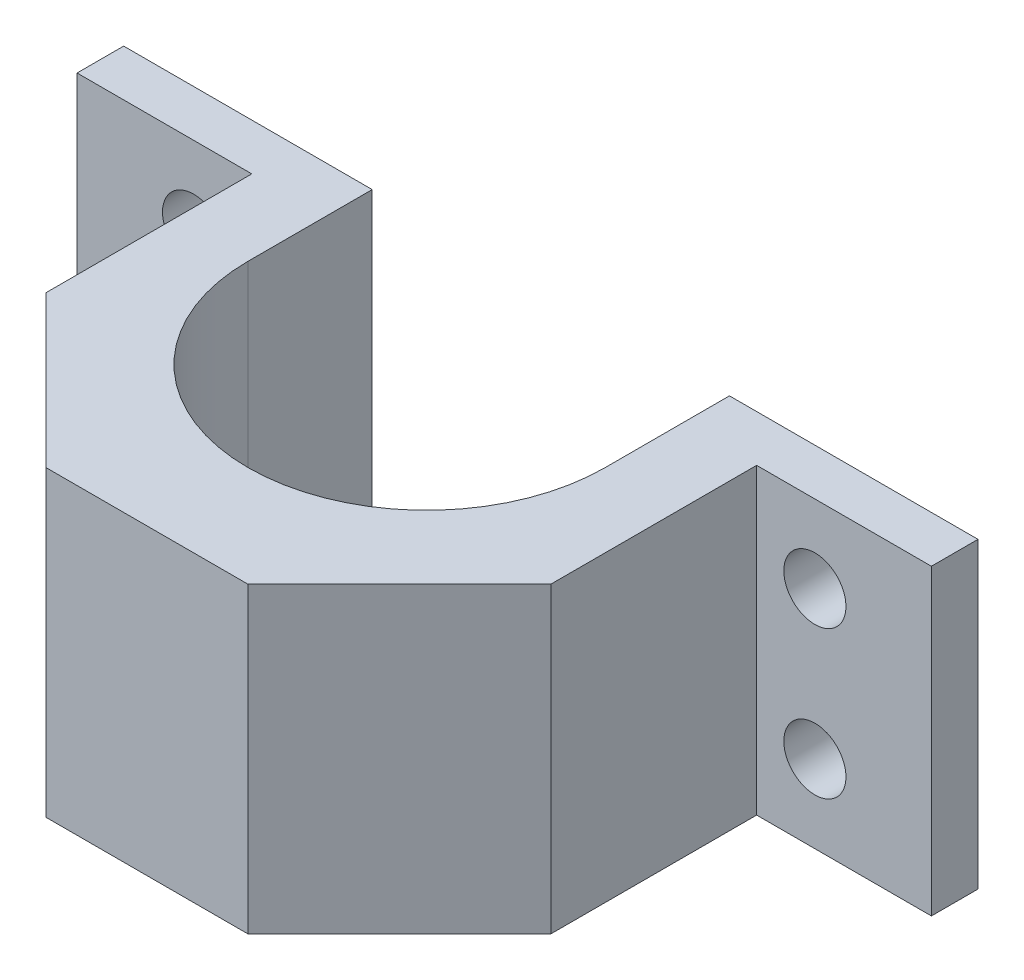
ISO-10303-21;
HEADER;
FILE_DESCRIPTION(('STEP AP214'),'2;1');
FILE_NAME('part.step','',(''),(''),'','','');
FILE_SCHEMA(('AUTOMOTIVE_DESIGN { 1 0 10303 214 1 1 1 1 }'));
ENDSEC;
DATA;
#1=APPLICATION_CONTEXT('core data for automotive mechanical design processes');
#2=APPLICATION_PROTOCOL_DEFINITION('international standard','automotive_design',2000,#1);
#3=PRODUCT_CONTEXT('',#1,'mechanical');
#4=PRODUCT('Part','Part','',(#3));
#5=PRODUCT_RELATED_PRODUCT_CATEGORY('part','',(#4));
#6=PRODUCT_DEFINITION_FORMATION('','',#4);
#7=PRODUCT_DEFINITION_CONTEXT('part definition',#1,'design');
#8=PRODUCT_DEFINITION('design','',#6,#7);
#9=PRODUCT_DEFINITION_SHAPE('','',#8);
#10=(LENGTH_UNIT() NAMED_UNIT(*) SI_UNIT(.MILLI.,.METRE.));
#11=(NAMED_UNIT(*) PLANE_ANGLE_UNIT() SI_UNIT($,.RADIAN.));
#12=(NAMED_UNIT(*) SI_UNIT($,.STERADIAN.) SOLID_ANGLE_UNIT());
#13=UNCERTAINTY_MEASURE_WITH_UNIT(LENGTH_MEASURE(1.E-05),#10,'distance_accuracy_value','');
#14=(GEOMETRIC_REPRESENTATION_CONTEXT(3) GLOBAL_UNCERTAINTY_ASSIGNED_CONTEXT((#13)) GLOBAL_UNIT_ASSIGNED_CONTEXT((#10,
#11,#12)) REPRESENTATION_CONTEXT('',''));
#15=CARTESIAN_POINT('',(0.,0.,0.));
#16=DIRECTION('',(0.,0.,1.));
#17=DIRECTION('',(1.,0.,0.));
#18=AXIS2_PLACEMENT_3D('',#15,#16,#17);
#19=CARTESIAN_POINT('',(32.5,39.,-10.));
#20=DIRECTION('',(0.,0.,-1.));
#21=DIRECTION('',(-1.,0.,0.));
#22=AXIS2_PLACEMENT_3D('',#19,#20,#21);
#23=PLANE('',#22);
#24=CARTESIAN_POINT('',(40.,10.,-10.));
#25=DIRECTION('',(0.,0.,-1.));
#26=DIRECTION('',(-1.,0.,0.));
#27=AXIS2_PLACEMENT_3D('',#24,#25,#26);
#28=CIRCLE('',#27,4.00000000000001);
#29=CARTESIAN_POINT('',(36.,10.,-10.));
#30=VERTEX_POINT('',#29);
#31=EDGE_CURVE('E187',#30,#30,#28,.T.);
#32=ORIENTED_EDGE('',*,*,#31,.T.);
#33=EDGE_LOOP('',(#32));
#34=FACE_BOUND('',#33,.T.);
#35=CARTESIAN_POINT('',(40.,29.,-10.));
#36=DIRECTION('',(0.,0.,-1.));
#37=DIRECTION('',(-1.,0.,0.));
#38=AXIS2_PLACEMENT_3D('',#35,#36,#37);
#39=CIRCLE('',#38,4.00000000000001);
#40=CARTESIAN_POINT('',(36.,29.,-10.));
#41=VERTEX_POINT('',#40);
#42=EDGE_CURVE('E275',#41,#41,#39,.T.);
#43=ORIENTED_EDGE('',*,*,#42,.T.);
#44=EDGE_LOOP('',(#43));
#45=FACE_BOUND('',#44,.T.);
#46=DIRECTION('',(1.,0.,0.));
#47=VECTOR('',#46,1.);
#48=CARTESIAN_POINT('',(32.5,0.,-10.));
#49=LINE('',#48,#47);
#50=CARTESIAN_POINT('',(32.5,0.,-10.));
#51=VERTEX_POINT('',#50);
#52=CARTESIAN_POINT('',(55.,0.,-10.));
#53=VERTEX_POINT('',#52);
#54=EDGE_CURVE('E182',#51,#53,#49,.T.);
#55=ORIENTED_EDGE('',*,*,#54,.T.);
#56=DIRECTION('',(0.,-1.,0.));
#57=VECTOR('',#56,1.);
#58=CARTESIAN_POINT('',(55.,39.,-10.));
#59=LINE('',#58,#57);
#60=CARTESIAN_POINT('',(55.,39.,-10.));
#61=VERTEX_POINT('',#60);
#62=EDGE_CURVE('E11',#61,#53,#59,.T.);
#63=ORIENTED_EDGE('',*,*,#62,.F.);
#64=DIRECTION('',(1.,0.,0.));
#65=VECTOR('',#64,1.);
#66=CARTESIAN_POINT('',(32.5,39.,-10.));
#67=LINE('',#66,#65);
#68=CARTESIAN_POINT('',(32.5,39.,-10.));
#69=VERTEX_POINT('',#68);
#70=EDGE_CURVE('E225',#69,#61,#67,.T.);
#71=ORIENTED_EDGE('',*,*,#70,.F.);
#72=DIRECTION('',(0.,-1.,0.));
#73=VECTOR('',#72,1.);
#74=CARTESIAN_POINT('',(32.5,39.,-10.));
#75=LINE('',#74,#73);
#76=EDGE_CURVE('E178',#69,#51,#75,.T.);
#77=ORIENTED_EDGE('',*,*,#76,.T.);
#78=EDGE_LOOP('',(#55,#63,#71,#77));
#79=FACE_BOUND('',#78,.T.);
#80=ADVANCED_FACE('F43',(#34,#45,#79),#23,.F.);
#81=CARTESIAN_POINT('',(55.,39.,-16.));
#82=DIRECTION('',(-1.,0.,0.));
#83=DIRECTION('',(0.,0.,1.));
#84=AXIS2_PLACEMENT_3D('',#81,#82,#83);
#85=PLANE('',#84);
#86=DIRECTION('',(0.,0.,-1.));
#87=VECTOR('',#86,1.);
#88=CARTESIAN_POINT('',(55.,0.,-16.));
#89=LINE('',#88,#87);
#90=CARTESIAN_POINT('',(55.,0.,-16.));
#91=VERTEX_POINT('',#90);
#92=EDGE_CURVE('E186',#53,#91,#89,.T.);
#93=ORIENTED_EDGE('',*,*,#92,.T.);
#94=DIRECTION('',(0.,-1.,0.));
#95=VECTOR('',#94,1.);
#96=CARTESIAN_POINT('',(55.,39.,-16.));
#97=LINE('',#96,#95);
#98=CARTESIAN_POINT('',(55.,39.,-16.));
#99=VERTEX_POINT('',#98);
#100=EDGE_CURVE('E53',#99,#91,#97,.T.);
#101=ORIENTED_EDGE('',*,*,#100,.F.);
#102=DIRECTION('',(0.,0.,-1.));
#103=VECTOR('',#102,1.);
#104=CARTESIAN_POINT('',(55.,39.,-16.));
#105=LINE('',#104,#103);
#106=EDGE_CURVE('E123',#61,#99,#105,.T.);
#107=ORIENTED_EDGE('',*,*,#106,.F.);
#108=ORIENTED_EDGE('',*,*,#62,.T.);
#109=EDGE_LOOP('',(#93,#101,#107,#108));
#110=FACE_BOUND('',#109,.T.);
#111=ADVANCED_FACE('F349',(#110),#85,.F.);
#112=CARTESIAN_POINT('',(23.,39.,-16.));
#113=DIRECTION('',(0.,0.,1.));
#114=DIRECTION('',(1.,0.,0.));
#115=AXIS2_PLACEMENT_3D('',#112,#113,#114);
#116=PLANE('',#115);
#117=CARTESIAN_POINT('',(40.,10.,-16.));
#118=DIRECTION('',(0.,0.,-1.));
#119=DIRECTION('',(-1.,0.,0.));
#120=AXIS2_PLACEMENT_3D('',#117,#118,#119);
#121=CIRCLE('',#120,4.00000000000001);
#122=CARTESIAN_POINT('',(36.,10.,-16.));
#123=VERTEX_POINT('',#122);
#124=EDGE_CURVE('E277',#123,#123,#121,.T.);
#125=ORIENTED_EDGE('',*,*,#124,.F.);
#126=EDGE_LOOP('',(#125));
#127=FACE_BOUND('',#126,.T.);
#128=CARTESIAN_POINT('',(40.,29.,-16.));
#129=DIRECTION('',(0.,0.,-1.));
#130=DIRECTION('',(-1.,0.,0.));
#131=AXIS2_PLACEMENT_3D('',#128,#129,#130);
#132=CIRCLE('',#131,4.00000000000001);
#133=CARTESIAN_POINT('',(36.,29.,-16.));
#134=VERTEX_POINT('',#133);
#135=EDGE_CURVE('E269',#134,#134,#132,.T.);
#136=ORIENTED_EDGE('',*,*,#135,.F.);
#137=EDGE_LOOP('',(#136));
#138=FACE_BOUND('',#137,.T.);
#139=DIRECTION('',(-1.,0.,0.));
#140=VECTOR('',#139,1.);
#141=CARTESIAN_POINT('',(23.,0.,-16.));
#142=LINE('',#141,#140);
#143=CARTESIAN_POINT('',(23.,0.,-16.));
#144=VERTEX_POINT('',#143);
#145=EDGE_CURVE('E190',#91,#144,#142,.T.);
#146=ORIENTED_EDGE('',*,*,#145,.T.);
#147=DIRECTION('',(0.,-1.,0.));
#148=VECTOR('',#147,1.);
#149=CARTESIAN_POINT('',(23.,39.,-16.));
#150=LINE('',#149,#148);
#151=CARTESIAN_POINT('',(23.,39.,-16.));
#152=VERTEX_POINT('',#151);
#153=EDGE_CURVE('E260',#152,#144,#150,.T.);
#154=ORIENTED_EDGE('',*,*,#153,.F.);
#155=DIRECTION('',(-1.,0.,0.));
#156=VECTOR('',#155,1.);
#157=CARTESIAN_POINT('',(23.,39.,-16.));
#158=LINE('',#157,#156);
#159=EDGE_CURVE('E297',#99,#152,#158,.T.);
#160=ORIENTED_EDGE('',*,*,#159,.F.);
#161=ORIENTED_EDGE('',*,*,#100,.T.);
#162=EDGE_LOOP('',(#146,#154,#160,#161));
#163=FACE_BOUND('',#162,.T.);
#164=ADVANCED_FACE('F354',(#127,#138,#163),#116,.F.);
#165=CARTESIAN_POINT('',(23.,39.,0.));
#166=DIRECTION('',(1.,0.,0.));
#167=DIRECTION('',(0.,0.,-1.));
#168=AXIS2_PLACEMENT_3D('',#165,#166,#167);
#169=PLANE('',#168);
#170=DIRECTION('',(0.,0.,1.));
#171=VECTOR('',#170,1.);
#172=CARTESIAN_POINT('',(23.,0.,0.));
#173=LINE('',#172,#171);
#174=CARTESIAN_POINT('',(23.,0.,0.));
#175=VERTEX_POINT('',#174);
#176=EDGE_CURVE('E194',#144,#175,#173,.T.);
#177=ORIENTED_EDGE('',*,*,#176,.T.);
#178=DIRECTION('',(0.,-1.,0.));
#179=VECTOR('',#178,1.);
#180=CARTESIAN_POINT('',(23.,39.,0.));
#181=LINE('',#180,#179);
#182=CARTESIAN_POINT('',(23.,39.,0.));
#183=VERTEX_POINT('',#182);
#184=EDGE_CURVE('E256',#183,#175,#181,.T.);
#185=ORIENTED_EDGE('',*,*,#184,.F.);
#186=DIRECTION('',(0.,0.,1.));
#187=VECTOR('',#186,1.);
#188=CARTESIAN_POINT('',(23.,39.,-10.));
#189=LINE('',#188,#187);
#190=EDGE_CURVE('E300',#152,#183,#189,.T.);
#191=ORIENTED_EDGE('',*,*,#190,.F.);
#192=ORIENTED_EDGE('',*,*,#153,.T.);
#193=EDGE_LOOP('',(#177,#185,#191,#192));
#194=FACE_BOUND('',#193,.T.);
#195=ADVANCED_FACE('F427',(#194),#169,.F.);
#196=CARTESIAN_POINT('',(0.,39.,0.));
#197=DIRECTION('',(0.,-1.,0.));
#198=DIRECTION('',(0.,0.,-1.));
#199=AXIS2_PLACEMENT_3D('',#196,#197,#198);
#200=CYLINDRICAL_SURFACE('',#199,23.);
#201=CARTESIAN_POINT('',(0.,0.,0.));
#202=DIRECTION('',(0.,-1.,0.));
#203=DIRECTION('',(0.,0.,1.));
#204=AXIS2_PLACEMENT_3D('',#201,#202,#203);
#205=CIRCLE('',#204,23.);
#206=CARTESIAN_POINT('',(-23.,0.,0.));
#207=VERTEX_POINT('',#206);
#208=EDGE_CURVE('E197',#175,#207,#205,.T.);
#209=ORIENTED_EDGE('',*,*,#208,.T.);
#210=DIRECTION('',(0.,-1.,0.));
#211=VECTOR('',#210,1.);
#212=CARTESIAN_POINT('',(-23.,39.,0.));
#213=LINE('',#212,#211);
#214=CARTESIAN_POINT('',(-23.,39.,0.));
#215=VERTEX_POINT('',#214);
#216=EDGE_CURVE('E252',#215,#207,#213,.T.);
#217=ORIENTED_EDGE('',*,*,#216,.F.);
#218=CARTESIAN_POINT('',(0.,39.,0.));
#219=DIRECTION('',(0.,-1.,0.));
#220=DIRECTION('',(0.,0.,1.));
#221=AXIS2_PLACEMENT_3D('',#218,#219,#220);
#222=CIRCLE('',#221,23.);
#223=EDGE_CURVE('E303',#183,#215,#222,.T.);
#224=ORIENTED_EDGE('',*,*,#223,.F.);
#225=ORIENTED_EDGE('',*,*,#184,.T.);
#226=EDGE_LOOP('',(#209,#217,#224,#225));
#227=FACE_BOUND('',#226,.T.);
#228=ADVANCED_FACE('F423',(#227),#200,.F.);
#229=CARTESIAN_POINT('',(-23.,39.,-10.));
#230=DIRECTION('',(-1.,0.,0.));
#231=DIRECTION('',(0.,0.,1.));
#232=AXIS2_PLACEMENT_3D('',#229,#230,#231);
#233=PLANE('',#232);
#234=DIRECTION('',(0.,0.,-1.));
#235=VECTOR('',#234,1.);
#236=CARTESIAN_POINT('',(-23.,0.,-10.));
#237=LINE('',#236,#235);
#238=CARTESIAN_POINT('',(-23.,0.,-16.));
#239=VERTEX_POINT('',#238);
#240=EDGE_CURVE('E201',#207,#239,#237,.T.);
#241=ORIENTED_EDGE('',*,*,#240,.T.);
#242=DIRECTION('',(0.,-1.,0.));
#243=VECTOR('',#242,1.);
#244=CARTESIAN_POINT('',(-23.,39.,-16.));
#245=LINE('',#244,#243);
#246=CARTESIAN_POINT('',(-23.,39.,-16.));
#247=VERTEX_POINT('',#246);
#248=EDGE_CURVE('E248',#247,#239,#245,.T.);
#249=ORIENTED_EDGE('',*,*,#248,.F.);
#250=DIRECTION('',(0.,0.,-1.));
#251=VECTOR('',#250,1.);
#252=CARTESIAN_POINT('',(-23.,39.,0.));
#253=LINE('',#252,#251);
#254=EDGE_CURVE('E306',#215,#247,#253,.T.);
#255=ORIENTED_EDGE('',*,*,#254,.F.);
#256=ORIENTED_EDGE('',*,*,#216,.T.);
#257=EDGE_LOOP('',(#241,#249,#255,#256));
#258=FACE_BOUND('',#257,.T.);
#259=ADVANCED_FACE('F396',(#258),#233,.F.);
#260=CARTESIAN_POINT('',(-55.,39.,-16.));
#261=DIRECTION('',(0.,0.,1.));
#262=DIRECTION('',(1.,0.,0.));
#263=AXIS2_PLACEMENT_3D('',#260,#261,#262);
#264=PLANE('',#263);
#265=CARTESIAN_POINT('',(-40.,29.,-16.));
#266=DIRECTION('',(0.,0.,-1.));
#267=DIRECTION('',(1.,0.,0.));
#268=AXIS2_PLACEMENT_3D('',#265,#266,#267);
#269=CIRCLE('',#268,4.00000000000001);
#270=CARTESIAN_POINT('',(-36.,29.,-16.));
#271=VERTEX_POINT('',#270);
#272=EDGE_CURVE('E283',#271,#271,#269,.T.);
#273=ORIENTED_EDGE('',*,*,#272,.F.);
#274=EDGE_LOOP('',(#273));
#275=FACE_BOUND('',#274,.T.);
#276=CARTESIAN_POINT('',(-40.,10.,-16.));
#277=DIRECTION('',(0.,0.,-1.));
#278=DIRECTION('',(1.,0.,0.));
#279=AXIS2_PLACEMENT_3D('',#276,#277,#278);
#280=CIRCLE('',#279,4.00000000000001);
#281=CARTESIAN_POINT('',(-36.,10.,-16.));
#282=VERTEX_POINT('',#281);
#283=EDGE_CURVE('E384',#282,#282,#280,.T.);
#284=ORIENTED_EDGE('',*,*,#283,.F.);
#285=EDGE_LOOP('',(#284));
#286=FACE_BOUND('',#285,.T.);
#287=DIRECTION('',(-1.,0.,0.));
#288=VECTOR('',#287,1.);
#289=CARTESIAN_POINT('',(-55.,0.,-16.));
#290=LINE('',#289,#288);
#291=CARTESIAN_POINT('',(-55.,0.,-16.));
#292=VERTEX_POINT('',#291);
#293=EDGE_CURVE('E204',#239,#292,#290,.T.);
#294=ORIENTED_EDGE('',*,*,#293,.T.);
#295=DIRECTION('',(0.,-1.,0.));
#296=VECTOR('',#295,1.);
#297=CARTESIAN_POINT('',(-55.,39.,-16.));
#298=LINE('',#297,#296);
#299=CARTESIAN_POINT('',(-55.,39.,-16.));
#300=VERTEX_POINT('',#299);
#301=EDGE_CURVE('E244',#300,#292,#298,.T.);
#302=ORIENTED_EDGE('',*,*,#301,.F.);
#303=DIRECTION('',(-1.,0.,0.));
#304=VECTOR('',#303,1.);
#305=CARTESIAN_POINT('',(-55.,39.,-16.));
#306=LINE('',#305,#304);
#307=EDGE_CURVE('E309',#247,#300,#306,.T.);
#308=ORIENTED_EDGE('',*,*,#307,.F.);
#309=ORIENTED_EDGE('',*,*,#248,.T.);
#310=EDGE_LOOP('',(#294,#302,#308,#309));
#311=FACE_BOUND('',#310,.T.);
#312=ADVANCED_FACE('F393',(#275,#286,#311),#264,.F.);
#313=CARTESIAN_POINT('',(-55.,39.,-16.));
#314=DIRECTION('',(1.,0.,0.));
#315=DIRECTION('',(0.,0.,-1.));
#316=AXIS2_PLACEMENT_3D('',#313,#314,#315);
#317=PLANE('',#316);
#318=DIRECTION('',(0.,0.,1.));
#319=VECTOR('',#318,1.);
#320=CARTESIAN_POINT('',(-55.,0.,-16.));
#321=LINE('',#320,#319);
#322=CARTESIAN_POINT('',(-55.,0.,-10.));
#323=VERTEX_POINT('',#322);
#324=EDGE_CURVE('E207',#292,#323,#321,.T.);
#325=ORIENTED_EDGE('',*,*,#324,.T.);
#326=DIRECTION('',(0.,-1.,0.));
#327=VECTOR('',#326,1.);
#328=CARTESIAN_POINT('',(-55.,39.,-10.));
#329=LINE('',#328,#327);
#330=CARTESIAN_POINT('',(-55.,39.,-10.));
#331=VERTEX_POINT('',#330);
#332=EDGE_CURVE('E240',#331,#323,#329,.T.);
#333=ORIENTED_EDGE('',*,*,#332,.F.);
#334=DIRECTION('',(0.,0.,1.));
#335=VECTOR('',#334,1.);
#336=CARTESIAN_POINT('',(-55.,39.,-16.));
#337=LINE('',#336,#335);
#338=EDGE_CURVE('E312',#300,#331,#337,.T.);
#339=ORIENTED_EDGE('',*,*,#338,.F.);
#340=ORIENTED_EDGE('',*,*,#301,.T.);
#341=EDGE_LOOP('',(#325,#333,#339,#340));
#342=FACE_BOUND('',#341,.T.);
#343=ADVANCED_FACE('F395',(#342),#317,.F.);
#344=CARTESIAN_POINT('',(-55.,39.,-10.));
#345=DIRECTION('',(0.,0.,-1.));
#346=DIRECTION('',(-1.,0.,0.));
#347=AXIS2_PLACEMENT_3D('',#344,#345,#346);
#348=PLANE('',#347);
#349=CARTESIAN_POINT('',(-40.,29.,-10.));
#350=DIRECTION('',(0.,0.,-1.));
#351=DIRECTION('',(-1.,0.,0.));
#352=AXIS2_PLACEMENT_3D('',#349,#350,#351);
#353=CIRCLE('',#352,4.00000000000001);
#354=CARTESIAN_POINT('',(-44.,29.,-10.));
#355=VERTEX_POINT('',#354);
#356=EDGE_CURVE('E46',#355,#355,#353,.T.);
#357=ORIENTED_EDGE('',*,*,#356,.T.);
#358=EDGE_LOOP('',(#357));
#359=FACE_BOUND('',#358,.T.);
#360=CARTESIAN_POINT('',(-40.,10.,-10.));
#361=DIRECTION('',(0.,0.,-1.));
#362=DIRECTION('',(-1.,0.,0.));
#363=AXIS2_PLACEMENT_3D('',#360,#361,#362);
#364=CIRCLE('',#363,4.00000000000001);
#365=CARTESIAN_POINT('',(-44.,10.,-10.));
#366=VERTEX_POINT('',#365);
#367=EDGE_CURVE('E266',#366,#366,#364,.T.);
#368=ORIENTED_EDGE('',*,*,#367,.T.);
#369=EDGE_LOOP('',(#368));
#370=FACE_BOUND('',#369,.T.);
#371=DIRECTION('',(1.,0.,0.));
#372=VECTOR('',#371,1.);
#373=CARTESIAN_POINT('',(-55.,0.,-10.));
#374=LINE('',#373,#372);
#375=CARTESIAN_POINT('',(-32.5,0.,-10.));
#376=VERTEX_POINT('',#375);
#377=EDGE_CURVE('E210',#323,#376,#374,.T.);
#378=ORIENTED_EDGE('',*,*,#377,.T.);
#379=DIRECTION('',(0.,-1.,0.));
#380=VECTOR('',#379,1.);
#381=CARTESIAN_POINT('',(-32.5,39.,-10.));
#382=LINE('',#381,#380);
#383=CARTESIAN_POINT('',(-32.5,39.,-10.));
#384=VERTEX_POINT('',#383);
#385=EDGE_CURVE('E236',#384,#376,#382,.T.);
#386=ORIENTED_EDGE('',*,*,#385,.F.);
#387=DIRECTION('',(1.,0.,0.));
#388=VECTOR('',#387,1.);
#389=CARTESIAN_POINT('',(-55.,39.,-10.));
#390=LINE('',#389,#388);
#391=EDGE_CURVE('E315',#331,#384,#390,.T.);
#392=ORIENTED_EDGE('',*,*,#391,.F.);
#393=ORIENTED_EDGE('',*,*,#332,.T.);
#394=EDGE_LOOP('',(#378,#386,#392,#393));
#395=FACE_BOUND('',#394,.T.);
#396=ADVANCED_FACE('F409',(#359,#370,#395),#348,.F.);
#397=CARTESIAN_POINT('',(-32.5,39.,16.5000000000002));
#398=DIRECTION('',(1.,0.,0.));
#399=DIRECTION('',(0.,0.,-1.));
#400=AXIS2_PLACEMENT_3D('',#397,#398,#399);
#401=PLANE('',#400);
#402=DIRECTION('',(0.,0.,1.));
#403=VECTOR('',#402,1.);
#404=CARTESIAN_POINT('',(-32.5,0.,16.5000000000002));
#405=LINE('',#404,#403);
#406=CARTESIAN_POINT('',(-32.5,0.,16.5000000000002));
#407=VERTEX_POINT('',#406);
#408=EDGE_CURVE('E213',#376,#407,#405,.T.);
#409=ORIENTED_EDGE('',*,*,#408,.T.);
#410=DIRECTION('',(0.,-1.,0.));
#411=VECTOR('',#410,1.);
#412=CARTESIAN_POINT('',(-32.5,39.,16.5000000000002));
#413=LINE('',#412,#411);
#414=CARTESIAN_POINT('',(-32.5,39.,16.5000000000002));
#415=VERTEX_POINT('',#414);
#416=EDGE_CURVE('E232',#415,#407,#413,.T.);
#417=ORIENTED_EDGE('',*,*,#416,.F.);
#418=DIRECTION('',(0.,0.,1.));
#419=VECTOR('',#418,1.);
#420=CARTESIAN_POINT('',(-32.5,39.,16.5000000000002));
#421=LINE('',#420,#419);
#422=EDGE_CURVE('E318',#384,#415,#421,.T.);
#423=ORIENTED_EDGE('',*,*,#422,.F.);
#424=ORIENTED_EDGE('',*,*,#385,.T.);
#425=EDGE_LOOP('',(#409,#417,#423,#424));
#426=FACE_BOUND('',#425,.T.);
#427=ADVANCED_FACE('F326',(#426),#401,.F.);
#428=CARTESIAN_POINT('',(-13.,39.,36.));
#429=DIRECTION('',(0.707106781186544,0.,-0.707106781186551));
#430=DIRECTION('',(-0.707106781186551,0.,-0.707106781186544));
#431=AXIS2_PLACEMENT_3D('',#428,#429,#430);
#432=PLANE('',#431);
#433=DIRECTION('',(0.707106781186551,0.,0.707106781186544));
#434=VECTOR('',#433,1.);
#435=CARTESIAN_POINT('',(-13.,0.,36.));
#436=LINE('',#435,#434);
#437=CARTESIAN_POINT('',(-13.,0.,36.));
#438=VERTEX_POINT('',#437);
#439=EDGE_CURVE('E216',#407,#438,#436,.T.);
#440=ORIENTED_EDGE('',*,*,#439,.T.);
#441=DIRECTION('',(0.,-1.,0.));
#442=VECTOR('',#441,1.);
#443=CARTESIAN_POINT('',(-13.,39.,36.));
#444=LINE('',#443,#442);
#445=CARTESIAN_POINT('',(-13.,39.,36.));
#446=VERTEX_POINT('',#445);
#447=EDGE_CURVE('E171',#446,#438,#444,.T.);
#448=ORIENTED_EDGE('',*,*,#447,.F.);
#449=DIRECTION('',(0.707106781186551,0.,0.707106781186544));
#450=VECTOR('',#449,1.);
#451=CARTESIAN_POINT('',(-13.,39.,36.));
#452=LINE('',#451,#450);
#453=EDGE_CURVE('E160',#415,#446,#452,.T.);
#454=ORIENTED_EDGE('',*,*,#453,.F.);
#455=ORIENTED_EDGE('',*,*,#416,.T.);
#456=EDGE_LOOP('',(#440,#448,#454,#455));
#457=FACE_BOUND('',#456,.T.);
#458=ADVANCED_FACE('F330',(#457),#432,.F.);
#459=CARTESIAN_POINT('',(-13.,39.,36.));
#460=DIRECTION('',(0.,0.,-1.));
#461=DIRECTION('',(-1.,0.,0.));
#462=AXIS2_PLACEMENT_3D('',#459,#460,#461);
#463=PLANE('',#462);
#464=DIRECTION('',(1.,0.,0.));
#465=VECTOR('',#464,1.);
#466=CARTESIAN_POINT('',(-13.,0.,36.));
#467=LINE('',#466,#465);
#468=CARTESIAN_POINT('',(13.,0.,36.));
#469=VERTEX_POINT('',#468);
#470=EDGE_CURVE('E169',#438,#469,#467,.T.);
#471=ORIENTED_EDGE('',*,*,#470,.T.);
#472=DIRECTION('',(0.,-1.,0.));
#473=VECTOR('',#472,1.);
#474=CARTESIAN_POINT('',(13.,39.,36.));
#475=LINE('',#474,#473);
#476=CARTESIAN_POINT('',(13.,39.,36.));
#477=VERTEX_POINT('',#476);
#478=EDGE_CURVE('E166',#477,#469,#475,.T.);
#479=ORIENTED_EDGE('',*,*,#478,.F.);
#480=DIRECTION('',(1.,0.,0.));
#481=VECTOR('',#480,1.);
#482=CARTESIAN_POINT('',(-13.,39.,36.));
#483=LINE('',#482,#481);
#484=EDGE_CURVE('E154',#446,#477,#483,.T.);
#485=ORIENTED_EDGE('',*,*,#484,.F.);
#486=ORIENTED_EDGE('',*,*,#447,.T.);
#487=EDGE_LOOP('',(#471,#479,#485,#486));
#488=FACE_BOUND('',#487,.T.);
#489=ADVANCED_FACE('F167',(#488),#463,.F.);
#490=CARTESIAN_POINT('',(13.,39.,36.));
#491=DIRECTION('',(-0.707106781186544,0.,-0.707106781186551));
#492=DIRECTION('',(-0.707106781186551,0.,0.707106781186544));
#493=AXIS2_PLACEMENT_3D('',#490,#491,#492);
#494=PLANE('',#493);
#495=DIRECTION('',(0.707106781186551,0.,-0.707106781186544));
#496=VECTOR('',#495,1.);
#497=CARTESIAN_POINT('',(13.,0.,36.));
#498=LINE('',#497,#496);
#499=CARTESIAN_POINT('',(32.5,0.,16.5000000000002));
#500=VERTEX_POINT('',#499);
#501=EDGE_CURVE('E109',#469,#500,#498,.T.);
#502=ORIENTED_EDGE('',*,*,#501,.T.);
#503=DIRECTION('',(0.,-1.,0.));
#504=VECTOR('',#503,1.);
#505=CARTESIAN_POINT('',(32.5,39.,16.5000000000002));
#506=LINE('',#505,#504);
#507=CARTESIAN_POINT('',(32.5,39.,16.5000000000002));
#508=VERTEX_POINT('',#507);
#509=EDGE_CURVE('E172',#508,#500,#506,.T.);
#510=ORIENTED_EDGE('',*,*,#509,.F.);
#511=DIRECTION('',(0.707106781186551,0.,-0.707106781186544));
#512=VECTOR('',#511,1.);
#513=CARTESIAN_POINT('',(13.,39.,36.));
#514=LINE('',#513,#512);
#515=EDGE_CURVE('E158',#477,#508,#514,.T.);
#516=ORIENTED_EDGE('',*,*,#515,.F.);
#517=ORIENTED_EDGE('',*,*,#478,.T.);
#518=EDGE_LOOP('',(#502,#510,#516,#517));
#519=FACE_BOUND('',#518,.T.);
#520=ADVANCED_FACE('F174',(#519),#494,.F.);
#521=CARTESIAN_POINT('',(32.5,39.,16.5000000000002));
#522=DIRECTION('',(-1.,0.,0.));
#523=DIRECTION('',(0.,0.,1.));
#524=AXIS2_PLACEMENT_3D('',#521,#522,#523);
#525=PLANE('',#524);
#526=DIRECTION('',(0.,0.,-1.));
#527=VECTOR('',#526,1.);
#528=CARTESIAN_POINT('',(32.5,0.,16.5000000000002));
#529=LINE('',#528,#527);
#530=EDGE_CURVE('E115',#500,#51,#529,.T.);
#531=ORIENTED_EDGE('',*,*,#530,.T.);
#532=ORIENTED_EDGE('',*,*,#76,.F.);
#533=DIRECTION('',(0.,0.,-1.));
#534=VECTOR('',#533,1.);
#535=CARTESIAN_POINT('',(32.5,39.,16.5000000000002));
#536=LINE('',#535,#534);
#537=EDGE_CURVE('E62',#508,#69,#536,.T.);
#538=ORIENTED_EDGE('',*,*,#537,.F.);
#539=ORIENTED_EDGE('',*,*,#509,.T.);
#540=EDGE_LOOP('',(#531,#532,#538,#539));
#541=FACE_BOUND('',#540,.T.);
#542=ADVANCED_FACE('F338',(#541),#525,.F.);
#543=CARTESIAN_POINT('',(0.,39.,0.));
#544=DIRECTION('',(0.,1.,0.));
#545=DIRECTION('',(0.,0.,1.));
#546=AXIS2_PLACEMENT_3D('',#543,#544,#545);
#547=PLANE('',#546);
#548=ORIENTED_EDGE('',*,*,#70,.T.);
#549=ORIENTED_EDGE('',*,*,#106,.T.);
#550=ORIENTED_EDGE('',*,*,#159,.T.);
#551=ORIENTED_EDGE('',*,*,#190,.T.);
#552=ORIENTED_EDGE('',*,*,#223,.T.);
#553=ORIENTED_EDGE('',*,*,#254,.T.);
#554=ORIENTED_EDGE('',*,*,#307,.T.);
#555=ORIENTED_EDGE('',*,*,#338,.T.);
#556=ORIENTED_EDGE('',*,*,#391,.T.);
#557=ORIENTED_EDGE('',*,*,#422,.T.);
#558=ORIENTED_EDGE('',*,*,#453,.T.);
#559=ORIENTED_EDGE('',*,*,#484,.T.);
#560=ORIENTED_EDGE('',*,*,#515,.T.);
#561=ORIENTED_EDGE('',*,*,#537,.T.);
#562=EDGE_LOOP('',(#548,#549,#550,#551,#552,#553,#554,#555,#556,#557,#558,#559,#560,#561));
#563=FACE_BOUND('',#562,.T.);
#564=ADVANCED_FACE('F156',(#563),#547,.T.);
#565=CARTESIAN_POINT('',(0.,0.,0.));
#566=DIRECTION('',(0.,1.,0.));
#567=DIRECTION('',(0.,0.,1.));
#568=AXIS2_PLACEMENT_3D('',#565,#566,#567);
#569=PLANE('',#568);
#570=ORIENTED_EDGE('',*,*,#54,.F.);
#571=ORIENTED_EDGE('',*,*,#530,.F.);
#572=ORIENTED_EDGE('',*,*,#501,.F.);
#573=ORIENTED_EDGE('',*,*,#470,.F.);
#574=ORIENTED_EDGE('',*,*,#439,.F.);
#575=ORIENTED_EDGE('',*,*,#408,.F.);
#576=ORIENTED_EDGE('',*,*,#377,.F.);
#577=ORIENTED_EDGE('',*,*,#324,.F.);
#578=ORIENTED_EDGE('',*,*,#293,.F.);
#579=ORIENTED_EDGE('',*,*,#240,.F.);
#580=ORIENTED_EDGE('',*,*,#208,.F.);
#581=ORIENTED_EDGE('',*,*,#176,.F.);
#582=ORIENTED_EDGE('',*,*,#145,.F.);
#583=ORIENTED_EDGE('',*,*,#92,.F.);
#584=EDGE_LOOP('',(#570,#571,#572,#573,#574,#575,#576,#577,#578,#579,#580,#581,#582,#583));
#585=FACE_BOUND('',#584,.T.);
#586=ADVANCED_FACE('F333',(#585),#569,.F.);
#587=CARTESIAN_POINT('',(-40.,10.,36.));
#588=DIRECTION('',(0.,0.,-1.));
#589=DIRECTION('',(-1.,0.,0.));
#590=AXIS2_PLACEMENT_3D('',#587,#588,#589);
#591=CYLINDRICAL_SURFACE('',#590,4.00000000000001);
#592=ORIENTED_EDGE('',*,*,#283,.T.);
#593=EDGE_LOOP('',(#592));
#594=FACE_BOUND('',#593,.T.);
#595=ORIENTED_EDGE('',*,*,#367,.F.);
#596=EDGE_LOOP('',(#595));
#597=FACE_BOUND('',#596,.T.);
#598=ADVANCED_FACE('F370',(#594,#597),#591,.F.);
#599=CARTESIAN_POINT('',(-40.,29.,36.));
#600=DIRECTION('',(0.,0.,-1.));
#601=DIRECTION('',(-1.,0.,0.));
#602=AXIS2_PLACEMENT_3D('',#599,#600,#601);
#603=CYLINDRICAL_SURFACE('',#602,4.00000000000001);
#604=ORIENTED_EDGE('',*,*,#272,.T.);
#605=EDGE_LOOP('',(#604));
#606=FACE_BOUND('',#605,.T.);
#607=ORIENTED_EDGE('',*,*,#356,.F.);
#608=EDGE_LOOP('',(#607));
#609=FACE_BOUND('',#608,.T.);
#610=ADVANCED_FACE('F362',(#606,#609),#603,.F.);
#611=CARTESIAN_POINT('',(40.,29.,36.));
#612=DIRECTION('',(0.,0.,-1.));
#613=DIRECTION('',(-1.,0.,0.));
#614=AXIS2_PLACEMENT_3D('',#611,#612,#613);
#615=CYLINDRICAL_SURFACE('',#614,4.00000000000001);
#616=ORIENTED_EDGE('',*,*,#135,.T.);
#617=EDGE_LOOP('',(#616));
#618=FACE_BOUND('',#617,.T.);
#619=ORIENTED_EDGE('',*,*,#42,.F.);
#620=EDGE_LOOP('',(#619));
#621=FACE_BOUND('',#620,.T.);
#622=ADVANCED_FACE('F359',(#618,#621),#615,.F.);
#623=CARTESIAN_POINT('',(40.,10.,36.));
#624=DIRECTION('',(0.,0.,-1.));
#625=DIRECTION('',(-1.,0.,0.));
#626=AXIS2_PLACEMENT_3D('',#623,#624,#625);
#627=CYLINDRICAL_SURFACE('',#626,4.00000000000001);
#628=ORIENTED_EDGE('',*,*,#124,.T.);
#629=EDGE_LOOP('',(#628));
#630=FACE_BOUND('',#629,.T.);
#631=ORIENTED_EDGE('',*,*,#31,.F.);
#632=EDGE_LOOP('',(#631));
#633=FACE_BOUND('',#632,.T.);
#634=ADVANCED_FACE('F361',(#630,#633),#627,.F.);
#635=CLOSED_SHELL('',(#80,#111,#164,#195,#228,#259,#312,#343,#396,#427,#458,#489,#520,#542,#564,
#586,#598,#610,#622,#634));
#636=MANIFOLD_SOLID_BREP('B2',#635);
#637=ADVANCED_BREP_SHAPE_REPRESENTATION('',(#18,#636),#14);
#638=SHAPE_DEFINITION_REPRESENTATION(#9,#637);
ENDSEC;
END-ISO-10303-21;
